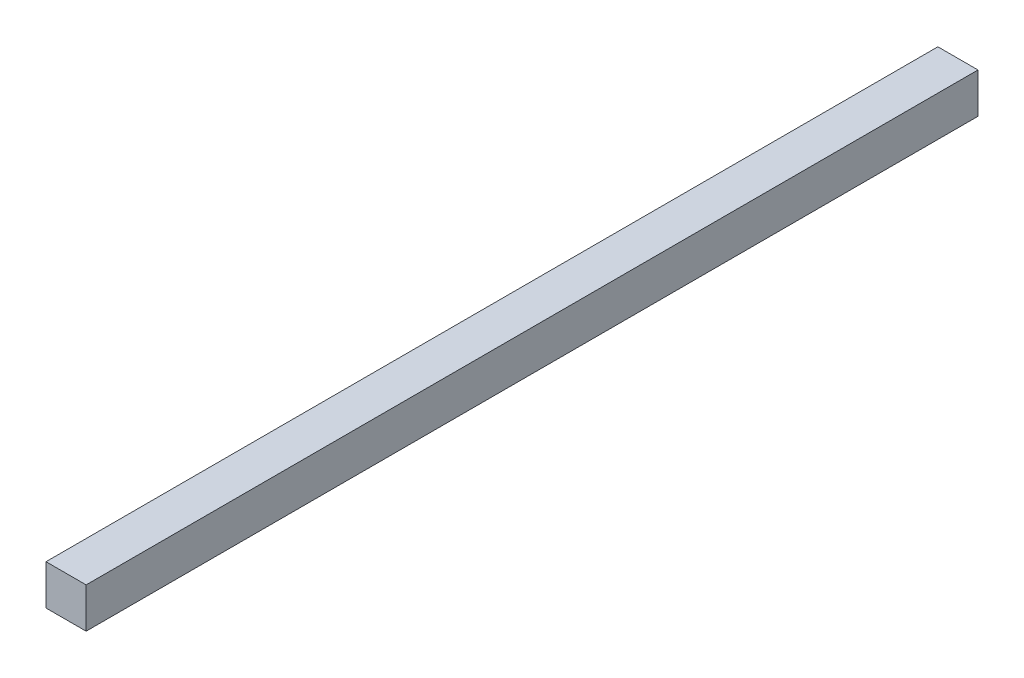
ISO-10303-21;
HEADER;
FILE_DESCRIPTION(('STEP AP214'),'2;1');
FILE_NAME('part.step','',(''),(''),'','','');
FILE_SCHEMA(('AUTOMOTIVE_DESIGN { 1 0 10303 214 1 1 1 1 }'));
ENDSEC;
DATA;
#1=APPLICATION_CONTEXT('core data for automotive mechanical design processes');
#2=APPLICATION_PROTOCOL_DEFINITION('international standard','automotive_design',2000,#1);
#3=PRODUCT_CONTEXT('',#1,'mechanical');
#4=PRODUCT('Part','Part','',(#3));
#5=PRODUCT_RELATED_PRODUCT_CATEGORY('part','',(#4));
#6=PRODUCT_DEFINITION_FORMATION('','',#4);
#7=PRODUCT_DEFINITION_CONTEXT('part definition',#1,'design');
#8=PRODUCT_DEFINITION('design','',#6,#7);
#9=PRODUCT_DEFINITION_SHAPE('','',#8);
#10=(LENGTH_UNIT() NAMED_UNIT(*) SI_UNIT(.MILLI.,.METRE.));
#11=(NAMED_UNIT(*) PLANE_ANGLE_UNIT() SI_UNIT($,.RADIAN.));
#12=(NAMED_UNIT(*) SI_UNIT($,.STERADIAN.) SOLID_ANGLE_UNIT());
#13=UNCERTAINTY_MEASURE_WITH_UNIT(LENGTH_MEASURE(1.E-05),#10,'distance_accuracy_value','');
#14=(GEOMETRIC_REPRESENTATION_CONTEXT(3) GLOBAL_UNCERTAINTY_ASSIGNED_CONTEXT((#13)) GLOBAL_UNIT_ASSIGNED_CONTEXT((#10,
#11,#12)) REPRESENTATION_CONTEXT('',''));
#15=CARTESIAN_POINT('',(0.,0.,0.));
#16=DIRECTION('',(0.,0.,1.));
#17=DIRECTION('',(1.,0.,0.));
#18=AXIS2_PLACEMENT_3D('',#15,#16,#17);
#19=CARTESIAN_POINT('',(0.,0.,-400.));
#20=DIRECTION('',(-1.,0.,0.));
#21=DIRECTION('',(0.,0.,1.));
#22=AXIS2_PLACEMENT_3D('',#19,#20,#21);
#23=PLANE('',#22);
#24=DIRECTION('',(0.,-1.,0.));
#25=VECTOR('',#24,1.);
#26=CARTESIAN_POINT('',(0.,0.,0.));
#27=LINE('',#26,#25);
#28=CARTESIAN_POINT('',(0.,18.,0.));
#29=VERTEX_POINT('',#28);
#30=CARTESIAN_POINT('',(0.,0.,0.));
#31=VERTEX_POINT('',#30);
#32=EDGE_CURVE('E95',#29,#31,#27,.T.);
#33=ORIENTED_EDGE('',*,*,#32,.F.);
#34=DIRECTION('',(0.,0.,1.));
#35=VECTOR('',#34,1.);
#36=CARTESIAN_POINT('',(0.,18.,-400.));
#37=LINE('',#36,#35);
#38=CARTESIAN_POINT('',(0.,18.,-400.));
#39=VERTEX_POINT('',#38);
#40=EDGE_CURVE('E11',#39,#29,#37,.T.);
#41=ORIENTED_EDGE('',*,*,#40,.F.);
#42=DIRECTION('',(0.,-1.,0.));
#43=VECTOR('',#42,1.);
#44=CARTESIAN_POINT('',(0.,0.,-400.));
#45=LINE('',#44,#43);
#46=CARTESIAN_POINT('',(0.,0.,-400.));
#47=VERTEX_POINT('',#46);
#48=EDGE_CURVE('E89',#39,#47,#45,.T.);
#49=ORIENTED_EDGE('',*,*,#48,.T.);
#50=DIRECTION('',(0.,0.,1.));
#51=VECTOR('',#50,1.);
#52=CARTESIAN_POINT('',(0.,0.,-400.));
#53=LINE('',#52,#51);
#54=EDGE_CURVE('E34',#47,#31,#53,.T.);
#55=ORIENTED_EDGE('',*,*,#54,.T.);
#56=EDGE_LOOP('',(#33,#41,#49,#55));
#57=FACE_BOUND('',#56,.T.);
#58=ADVANCED_FACE('F31',(#57),#23,.T.);
#59=CARTESIAN_POINT('',(0.,18.,-400.));
#60=DIRECTION('',(0.,1.,0.));
#61=DIRECTION('',(0.,0.,1.));
#62=AXIS2_PLACEMENT_3D('',#59,#60,#61);
#63=PLANE('',#62);
#64=DIRECTION('',(-1.,0.,0.));
#65=VECTOR('',#64,1.);
#66=CARTESIAN_POINT('',(0.,18.,0.));
#67=LINE('',#66,#65);
#68=CARTESIAN_POINT('',(18.,18.,0.));
#69=VERTEX_POINT('',#68);
#70=EDGE_CURVE('E91',#69,#29,#67,.T.);
#71=ORIENTED_EDGE('',*,*,#70,.F.);
#72=DIRECTION('',(0.,0.,1.));
#73=VECTOR('',#72,1.);
#74=CARTESIAN_POINT('',(18.,18.,-400.));
#75=LINE('',#74,#73);
#76=CARTESIAN_POINT('',(18.,18.,-400.));
#77=VERTEX_POINT('',#76);
#78=EDGE_CURVE('E40',#77,#69,#75,.T.);
#79=ORIENTED_EDGE('',*,*,#78,.F.);
#80=DIRECTION('',(-1.,0.,0.));
#81=VECTOR('',#80,1.);
#82=CARTESIAN_POINT('',(0.,18.,-400.));
#83=LINE('',#82,#81);
#84=EDGE_CURVE('E86',#77,#39,#83,.T.);
#85=ORIENTED_EDGE('',*,*,#84,.T.);
#86=ORIENTED_EDGE('',*,*,#40,.T.);
#87=EDGE_LOOP('',(#71,#79,#85,#86));
#88=FACE_BOUND('',#87,.T.);
#89=ADVANCED_FACE('F105',(#88),#63,.T.);
#90=CARTESIAN_POINT('',(18.,0.,-400.));
#91=DIRECTION('',(1.,0.,0.));
#92=DIRECTION('',(0.,0.,-1.));
#93=AXIS2_PLACEMENT_3D('',#90,#91,#92);
#94=PLANE('',#93);
#95=DIRECTION('',(0.,1.,0.));
#96=VECTOR('',#95,1.);
#97=CARTESIAN_POINT('',(18.,0.,0.));
#98=LINE('',#97,#96);
#99=CARTESIAN_POINT('',(18.,0.,0.));
#100=VERTEX_POINT('',#99);
#101=EDGE_CURVE('E81',#100,#69,#98,.T.);
#102=ORIENTED_EDGE('',*,*,#101,.F.);
#103=DIRECTION('',(0.,0.,1.));
#104=VECTOR('',#103,1.);
#105=CARTESIAN_POINT('',(18.,0.,-400.));
#106=LINE('',#105,#104);
#107=CARTESIAN_POINT('',(18.,0.,-400.));
#108=VERTEX_POINT('',#107);
#109=EDGE_CURVE('E76',#108,#100,#106,.T.);
#110=ORIENTED_EDGE('',*,*,#109,.F.);
#111=DIRECTION('',(0.,1.,0.));
#112=VECTOR('',#111,1.);
#113=CARTESIAN_POINT('',(18.,0.,-400.));
#114=LINE('',#113,#112);
#115=EDGE_CURVE('E79',#108,#77,#114,.T.);
#116=ORIENTED_EDGE('',*,*,#115,.T.);
#117=ORIENTED_EDGE('',*,*,#78,.T.);
#118=EDGE_LOOP('',(#102,#110,#116,#117));
#119=FACE_BOUND('',#118,.T.);
#120=ADVANCED_FACE('F78',(#119),#94,.T.);
#121=CARTESIAN_POINT('',(0.,0.,-400.));
#122=DIRECTION('',(0.,-1.,0.));
#123=DIRECTION('',(0.,0.,-1.));
#124=AXIS2_PLACEMENT_3D('',#121,#122,#123);
#125=PLANE('',#124);
#126=DIRECTION('',(1.,0.,0.));
#127=VECTOR('',#126,1.);
#128=CARTESIAN_POINT('',(0.,0.,0.));
#129=LINE('',#128,#127);
#130=EDGE_CURVE('E98',#31,#100,#129,.T.);
#131=ORIENTED_EDGE('',*,*,#130,.F.);
#132=ORIENTED_EDGE('',*,*,#54,.F.);
#133=DIRECTION('',(1.,0.,0.));
#134=VECTOR('',#133,1.);
#135=CARTESIAN_POINT('',(0.,0.,-400.));
#136=LINE('',#135,#134);
#137=EDGE_CURVE('E85',#47,#108,#136,.T.);
#138=ORIENTED_EDGE('',*,*,#137,.T.);
#139=ORIENTED_EDGE('',*,*,#109,.T.);
#140=EDGE_LOOP('',(#131,#132,#138,#139));
#141=FACE_BOUND('',#140,.T.);
#142=ADVANCED_FACE('F88',(#141),#125,.T.);
#143=CARTESIAN_POINT('',(0.,18.,-400.));
#144=DIRECTION('',(0.,0.,-1.));
#145=DIRECTION('',(-1.,0.,0.));
#146=AXIS2_PLACEMENT_3D('',#143,#144,#145);
#147=PLANE('',#146);
#148=ORIENTED_EDGE('',*,*,#48,.F.);
#149=ORIENTED_EDGE('',*,*,#84,.F.);
#150=ORIENTED_EDGE('',*,*,#115,.F.);
#151=ORIENTED_EDGE('',*,*,#137,.F.);
#152=EDGE_LOOP('',(#148,#149,#150,#151));
#153=FACE_BOUND('',#152,.T.);
#154=ADVANCED_FACE('F84',(#153),#147,.T.);
#155=CARTESIAN_POINT('',(0.,18.,0.));
#156=DIRECTION('',(0.,0.,-1.));
#157=DIRECTION('',(-1.,0.,0.));
#158=AXIS2_PLACEMENT_3D('',#155,#156,#157);
#159=PLANE('',#158);
#160=ORIENTED_EDGE('',*,*,#32,.T.);
#161=ORIENTED_EDGE('',*,*,#130,.T.);
#162=ORIENTED_EDGE('',*,*,#101,.T.);
#163=ORIENTED_EDGE('',*,*,#70,.T.);
#164=EDGE_LOOP('',(#160,#161,#162,#163));
#165=FACE_BOUND('',#164,.T.);
#166=ADVANCED_FACE('F104',(#165),#159,.F.);
#167=CLOSED_SHELL('',(#58,#89,#120,#142,#154,#166));
#168=MANIFOLD_SOLID_BREP('B2',#167);
#169=ADVANCED_BREP_SHAPE_REPRESENTATION('',(#18,#168),#14);
#170=SHAPE_DEFINITION_REPRESENTATION(#9,#169);
ENDSEC;
END-ISO-10303-21;
